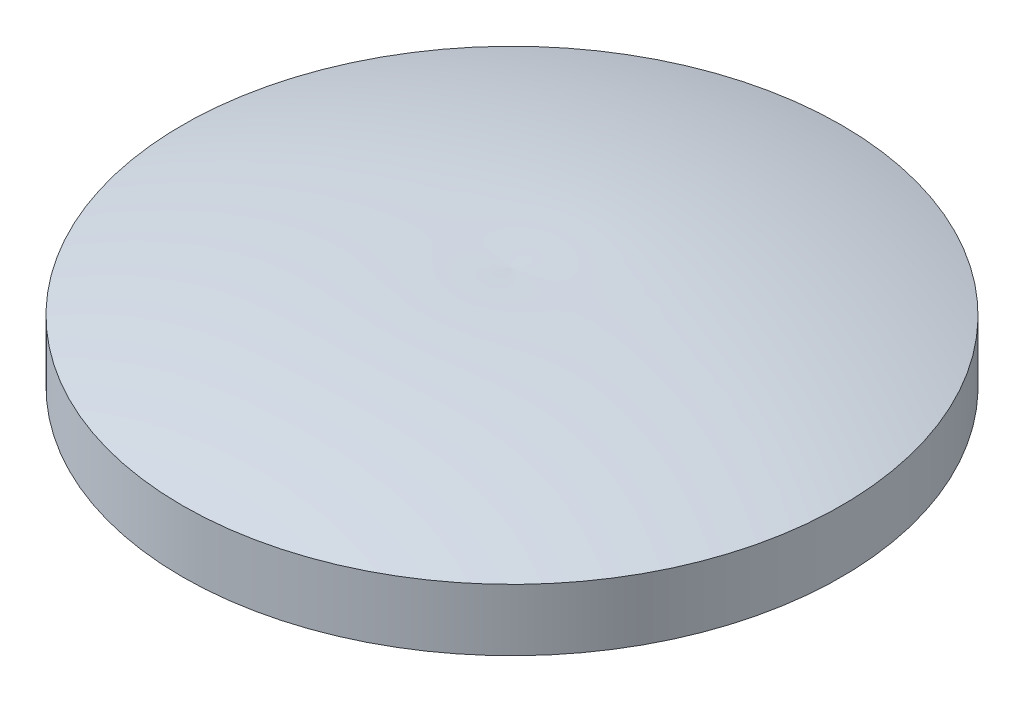
ISO-10303-21;
HEADER;
FILE_DESCRIPTION(('STEP AP214'),'2;1');
FILE_NAME('part.step','',(''),(''),'','','');
FILE_SCHEMA(('AUTOMOTIVE_DESIGN { 1 0 10303 214 1 1 1 1 }'));
ENDSEC;
DATA;
#1=APPLICATION_CONTEXT('core data for automotive mechanical design processes');
#2=APPLICATION_PROTOCOL_DEFINITION('international standard','automotive_design',2000,#1);
#3=PRODUCT_CONTEXT('',#1,'mechanical');
#4=PRODUCT('Part','Part','',(#3));
#5=PRODUCT_RELATED_PRODUCT_CATEGORY('part','',(#4));
#6=PRODUCT_DEFINITION_FORMATION('','',#4);
#7=PRODUCT_DEFINITION_CONTEXT('part definition',#1,'design');
#8=PRODUCT_DEFINITION('design','',#6,#7);
#9=PRODUCT_DEFINITION_SHAPE('','',#8);
#10=(LENGTH_UNIT() NAMED_UNIT(*) SI_UNIT(.MILLI.,.METRE.));
#11=(NAMED_UNIT(*) PLANE_ANGLE_UNIT() SI_UNIT($,.RADIAN.));
#12=(NAMED_UNIT(*) SI_UNIT($,.STERADIAN.) SOLID_ANGLE_UNIT());
#13=UNCERTAINTY_MEASURE_WITH_UNIT(LENGTH_MEASURE(1.E-05),#10,'distance_accuracy_value','');
#14=(GEOMETRIC_REPRESENTATION_CONTEXT(3) GLOBAL_UNCERTAINTY_ASSIGNED_CONTEXT((#13)) GLOBAL_UNIT_ASSIGNED_CONTEXT((#10,
#11,#12)) REPRESENTATION_CONTEXT('',''));
#15=CARTESIAN_POINT('',(0.,0.,0.));
#16=DIRECTION('',(0.,0.,1.));
#17=DIRECTION('',(1.,0.,0.));
#18=AXIS2_PLACEMENT_3D('',#15,#16,#17);
#19=CARTESIAN_POINT('',(0.,0.,0.));
#20=DIRECTION('',(0.,1.,0.));
#21=DIRECTION('',(0.,0.,1.));
#22=AXIS2_PLACEMENT_3D('',#19,#20,#21);
#23=PLANE('',#22);
#24=CARTESIAN_POINT('',(0.,0.,0.));
#25=DIRECTION('',(0.,-1.,0.));
#26=DIRECTION('',(0.,0.,-1.));
#27=AXIS2_PLACEMENT_3D('',#24,#25,#26);
#28=CIRCLE('',#27,20.32);
#29=CARTESIAN_POINT('',(0.,0.,-20.32));
#30=VERTEX_POINT('',#29);
#31=EDGE_CURVE('E11',#30,#30,#28,.T.);
#32=ORIENTED_EDGE('',*,*,#31,.T.);
#33=EDGE_LOOP('',(#32));
#34=FACE_BOUND('',#33,.T.);
#35=ADVANCED_FACE('F33',(#34),#23,.F.);
#36=CARTESIAN_POINT('',(0.,0.,0.));
#37=DIRECTION('',(0.,-1.,0.));
#38=DIRECTION('',(0.,0.,-1.));
#39=AXIS2_PLACEMENT_3D('',#36,#37,#38);
#40=CYLINDRICAL_SURFACE('',#39,20.32);
#41=ORIENTED_EDGE('',*,*,#31,.F.);
#42=EDGE_LOOP('',(#41));
#43=FACE_BOUND('',#42,.T.);
#44=CARTESIAN_POINT('',(0.,3.81,0.));
#45=DIRECTION('',(0.,-1.,0.));
#46=DIRECTION('',(0.,0.,-1.));
#47=AXIS2_PLACEMENT_3D('',#44,#45,#46);
#48=CIRCLE('',#47,20.32);
#49=CARTESIAN_POINT('',(0.,3.81,-20.32));
#50=VERTEX_POINT('',#49);
#51=EDGE_CURVE('E39',#50,#50,#48,.T.);
#52=ORIENTED_EDGE('',*,*,#51,.T.);
#53=EDGE_LOOP('',(#52));
#54=FACE_BOUND('',#53,.T.);
#55=ADVANCED_FACE('F44',(#43,#54),#40,.T.);
#56=CARTESIAN_POINT('',(0.,-50.7111181241106,-3.18611023448617));
#57=DIRECTION('',(-1.,0.,0.));
#58=DIRECTION('',(0.,0.,-1.));
#59=AXIS2_PLACEMENT_3D('',#56,#57,#58);
#60=CIRCLE('',#59,57.15);
#61=TRIMMED_CURVE('',#60,(PARAMETER_VALUE(-1.62657520663832)),
(PARAMETER_VALUE(1.62657520663832)),.T.,.PARAMETER.);
#62=CARTESIAN_POINT('',(0.,-50.7111181241106,0.));
#63=DIRECTION('',(0.,-1.,0.));
#64=AXIS1_PLACEMENT('',#62,#63);
#65=SURFACE_OF_REVOLUTION('',#61,#64);
#66=ORIENTED_EDGE('',*,*,#51,.F.);
#67=EDGE_LOOP('',(#66));
#68=FACE_BOUND('',#67,.T.);
#69=CARTESIAN_POINT('',(0.,6.35,0.));
#70=VERTEX_POINT('',#69);
#71=VERTEX_LOOP('',#70);
#72=FACE_BOUND('',#71,.T.);
#73=ADVANCED_FACE('F42',(#68,#72),#65,.T.);
#74=CLOSED_SHELL('',(#35,#55,#73));
#75=MANIFOLD_SOLID_BREP('B2',#74);
#76=ADVANCED_BREP_SHAPE_REPRESENTATION('',(#18,#75),#14);
#77=SHAPE_DEFINITION_REPRESENTATION(#9,#76);
ENDSEC;
END-ISO-10303-21;
